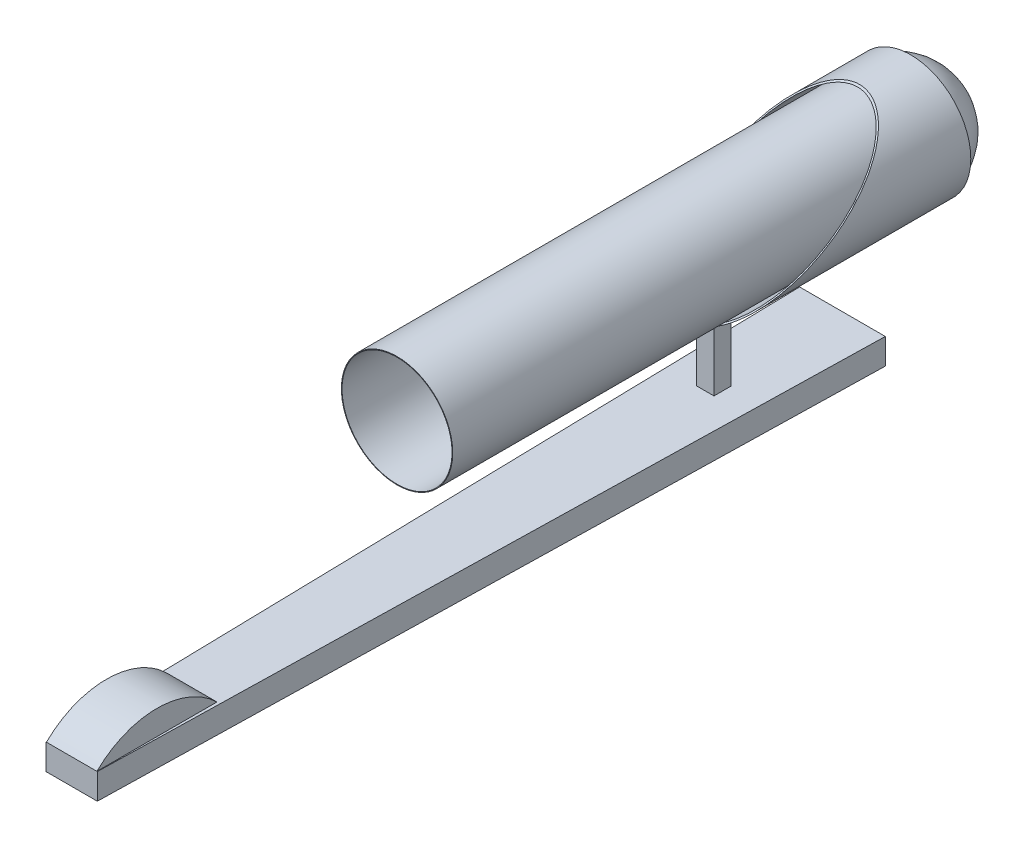
ISO-10303-21;
HEADER;
FILE_DESCRIPTION(('STEP AP214'),'2;1');
FILE_NAME('part.step','',(''),(''),'','','');
FILE_SCHEMA(('AUTOMOTIVE_DESIGN { 1 0 10303 214 1 1 1 1 }'));
ENDSEC;
DATA;
#1=APPLICATION_CONTEXT('core data for automotive mechanical design processes');
#2=APPLICATION_PROTOCOL_DEFINITION('international standard','automotive_design',2000,#1);
#3=PRODUCT_CONTEXT('',#1,'mechanical');
#4=PRODUCT('Part','Part','',(#3));
#5=PRODUCT_RELATED_PRODUCT_CATEGORY('part','',(#4));
#6=PRODUCT_DEFINITION_FORMATION('','',#4);
#7=PRODUCT_DEFINITION_CONTEXT('part definition',#1,'design');
#8=PRODUCT_DEFINITION('design','',#6,#7);
#9=PRODUCT_DEFINITION_SHAPE('','',#8);
#10=(LENGTH_UNIT() NAMED_UNIT(*) SI_UNIT(.MILLI.,.METRE.));
#11=(NAMED_UNIT(*) PLANE_ANGLE_UNIT() SI_UNIT($,.RADIAN.));
#12=(NAMED_UNIT(*) SI_UNIT($,.STERADIAN.) SOLID_ANGLE_UNIT());
#13=UNCERTAINTY_MEASURE_WITH_UNIT(LENGTH_MEASURE(1.E-05),#10,'distance_accuracy_value','');
#14=(GEOMETRIC_REPRESENTATION_CONTEXT(3) GLOBAL_UNCERTAINTY_ASSIGNED_CONTEXT((#13)) GLOBAL_UNIT_ASSIGNED_CONTEXT((#10,
#11,#12)) REPRESENTATION_CONTEXT('',''));
#15=CARTESIAN_POINT('',(0.,0.,0.));
#16=DIRECTION('',(0.,0.,1.));
#17=DIRECTION('',(1.,0.,0.));
#18=AXIS2_PLACEMENT_3D('',#15,#16,#17);
#19=CARTESIAN_POINT('',(0.,-7.493,0.));
#20=DIRECTION('',(0.,-1.,0.));
#21=DIRECTION('',(0.,0.,-1.));
#22=AXIS2_PLACEMENT_3D('',#19,#20,#21);
#23=PLANE('',#22);
#24=DIRECTION('',(-1.,0.,0.));
#25=VECTOR('',#24,1.);
#26=CARTESIAN_POINT('',(0.508,-7.493,-17.99844));
#27=LINE('',#26,#25);
#28=CARTESIAN_POINT('',(0.508,-7.493,-17.99844));
#29=VERTEX_POINT('',#28);
#30=CARTESIAN_POINT('',(-0.508,-7.493,-17.99844));
#31=VERTEX_POINT('',#30);
#32=EDGE_CURVE('E51',#29,#31,#27,.T.);
#33=ORIENTED_EDGE('',*,*,#32,.T.);
#34=DIRECTION('',(0.,0.,-1.));
#35=VECTOR('',#34,1.);
#36=CARTESIAN_POINT('',(-0.508,-7.493,-17.99844));
#37=LINE('',#36,#35);
#38=CARTESIAN_POINT('',(-0.508,-7.493,-18.9992));
#39=VERTEX_POINT('',#38);
#40=EDGE_CURVE('E190',#31,#39,#37,.T.);
#41=ORIENTED_EDGE('',*,*,#40,.T.);
#42=DIRECTION('',(-1.,0.,0.));
#43=VECTOR('',#42,1.);
#44=CARTESIAN_POINT('',(0.508,-7.493,-18.9992));
#45=LINE('',#44,#43);
#46=CARTESIAN_POINT('',(0.508,-7.493,-18.9992));
#47=VERTEX_POINT('',#46);
#48=EDGE_CURVE('E196',#47,#39,#45,.T.);
#49=ORIENTED_EDGE('',*,*,#48,.F.);
#50=DIRECTION('',(0.,0.,-1.));
#51=VECTOR('',#50,1.);
#52=CARTESIAN_POINT('',(0.508,-7.493,-17.99844));
#53=LINE('',#52,#51);
#54=EDGE_CURVE('E180',#29,#47,#53,.T.);
#55=ORIENTED_EDGE('',*,*,#54,.F.);
#56=EDGE_LOOP('',(#33,#41,#49,#55));
#57=FACE_BOUND('',#56,.T.);
#58=DIRECTION('',(0.,0.,-1.));
#59=VECTOR('',#58,1.);
#60=CARTESIAN_POINT('',(1.4732,-7.493,18.9992));
#61=LINE('',#60,#59);
#62=CARTESIAN_POINT('',(1.4732,-7.493,18.9992));
#63=VERTEX_POINT('',#62);
#64=CARTESIAN_POINT('',(1.4732,-7.493,11.9888));
#65=VERTEX_POINT('',#64);
#66=EDGE_CURVE('E131',#63,#65,#61,.T.);
#67=ORIENTED_EDGE('',*,*,#66,.F.);
#68=DIRECTION('',(1.,0.,0.));
#69=VECTOR('',#68,1.);
#70=CARTESIAN_POINT('',(1.4986,-7.493,18.9992));
#71=LINE('',#70,#69);
#72=CARTESIAN_POINT('',(1.4986,-7.493,18.9992));
#73=VERTEX_POINT('',#72);
#74=EDGE_CURVE('E119',#63,#73,#71,.T.);
#75=ORIENTED_EDGE('',*,*,#74,.T.);
#76=DIRECTION('',(0.0222856602321828,0.,-0.999751643833615));
#77=VECTOR('',#76,1.);
#78=CARTESIAN_POINT('',(2.5019,-7.493,-26.0096));
#79=LINE('',#78,#77);
#80=CARTESIAN_POINT('',(2.5019,-7.493,-26.0096));
#81=VERTEX_POINT('',#80);
#82=EDGE_CURVE('E163',#73,#81,#79,.T.);
#83=ORIENTED_EDGE('',*,*,#82,.T.);
#84=DIRECTION('',(-1.,0.,0.));
#85=VECTOR('',#84,1.);
#86=CARTESIAN_POINT('',(-2.5019,-7.493,-26.0096));
#87=LINE('',#86,#85);
#88=CARTESIAN_POINT('',(-2.5019,-7.493,-26.0096));
#89=VERTEX_POINT('',#88);
#90=EDGE_CURVE('E154',#81,#89,#87,.T.);
#91=ORIENTED_EDGE('',*,*,#90,.T.);
#92=DIRECTION('',(0.0222856602321827,0.,0.999751643833615));
#93=VECTOR('',#92,1.);
#94=CARTESIAN_POINT('',(-1.4986,-7.493,18.9992));
#95=LINE('',#94,#93);
#96=CARTESIAN_POINT('',(-1.4986,-7.493,18.9992));
#97=VERTEX_POINT('',#96);
#98=EDGE_CURVE('E129',#89,#97,#95,.T.);
#99=ORIENTED_EDGE('',*,*,#98,.T.);
#100=CARTESIAN_POINT('',(-1.4732,-7.493,18.9992));
#101=VERTEX_POINT('',#100);
#102=EDGE_CURVE('E128',#97,#101,#71,.T.);
#103=ORIENTED_EDGE('',*,*,#102,.T.);
#104=DIRECTION('',(0.,0.,-1.));
#105=VECTOR('',#104,1.);
#106=CARTESIAN_POINT('',(-1.4732,-7.493,18.9992));
#107=LINE('',#106,#105);
#108=CARTESIAN_POINT('',(-1.4732,-7.493,11.9888));
#109=VERTEX_POINT('',#108);
#110=EDGE_CURVE('E63',#101,#109,#107,.T.);
#111=ORIENTED_EDGE('',*,*,#110,.T.);
#112=DIRECTION('',(-1.,0.,0.));
#113=VECTOR('',#112,1.);
#114=CARTESIAN_POINT('',(1.4732,-7.493,11.9888));
#115=LINE('',#114,#113);
#116=EDGE_CURVE('E58',#65,#109,#115,.T.);
#117=ORIENTED_EDGE('',*,*,#116,.F.);
#118=EDGE_LOOP('',(#67,#75,#83,#91,#99,#103,#111,#117));
#119=FACE_BOUND('',#118,.T.);
#120=ADVANCED_FACE('F43',(#57,#119),#23,.F.);
#121=CARTESIAN_POINT('',(0.508,-3.5052,-17.99844));
#122=DIRECTION('',(0.,-1.,0.));
#123=DIRECTION('',(0.,0.,-1.));
#124=AXIS2_PLACEMENT_3D('',#121,#122,#123);
#125=PLANE('',#124);
#126=DIRECTION('',(0.,0.,1.));
#127=VECTOR('',#126,1.);
#128=CARTESIAN_POINT('',(-0.508,-3.5052,-17.99844));
#129=LINE('',#128,#127);
#130=CARTESIAN_POINT('',(-0.508,-3.5052,-18.9992));
#131=VERTEX_POINT('',#130);
#132=CARTESIAN_POINT('',(-0.508,-3.5052,-17.99844));
#133=VERTEX_POINT('',#132);
#134=EDGE_CURVE('E169',#131,#133,#129,.T.);
#135=ORIENTED_EDGE('',*,*,#134,.T.);
#136=DIRECTION('',(-1.,0.,0.));
#137=VECTOR('',#136,1.);
#138=CARTESIAN_POINT('',(0.508,-3.5052,-17.99844));
#139=LINE('',#138,#137);
#140=CARTESIAN_POINT('',(0.508,-3.5052,-17.99844));
#141=VERTEX_POINT('',#140);
#142=EDGE_CURVE('E12',#141,#133,#139,.T.);
#143=ORIENTED_EDGE('',*,*,#142,.F.);
#144=DIRECTION('',(0.,0.,1.));
#145=VECTOR('',#144,1.);
#146=CARTESIAN_POINT('',(0.508,-3.5052,-17.99844));
#147=LINE('',#146,#145);
#148=CARTESIAN_POINT('',(0.508,-3.5052,-18.9992));
#149=VERTEX_POINT('',#148);
#150=EDGE_CURVE('E174',#149,#141,#147,.T.);
#151=ORIENTED_EDGE('',*,*,#150,.F.);
#152=DIRECTION('',(-1.,0.,0.));
#153=VECTOR('',#152,1.);
#154=CARTESIAN_POINT('',(0.508,-3.5052,-18.9992));
#155=LINE('',#154,#153);
#156=EDGE_CURVE('E184',#149,#131,#155,.T.);
#157=ORIENTED_EDGE('',*,*,#156,.T.);
#158=EDGE_LOOP('',(#135,#143,#151,#157));
#159=FACE_BOUND('',#158,.T.);
#160=ADVANCED_FACE('F45',(#159),#125,.F.);
#161=CARTESIAN_POINT('',(0.508,-3.5052,-17.99844));
#162=DIRECTION('',(0.,0.,-1.));
#163=DIRECTION('',(-1.,0.,0.));
#164=AXIS2_PLACEMENT_3D('',#161,#162,#163);
#165=PLANE('',#164);
#166=DIRECTION('',(0.,-1.,0.));
#167=VECTOR('',#166,1.);
#168=CARTESIAN_POINT('',(-0.508,-3.5052,-17.99844));
#169=LINE('',#168,#167);
#170=EDGE_CURVE('E187',#133,#31,#169,.T.);
#171=ORIENTED_EDGE('',*,*,#170,.T.);
#172=ORIENTED_EDGE('',*,*,#32,.F.);
#173=DIRECTION('',(0.,-1.,0.));
#174=VECTOR('',#173,1.);
#175=CARTESIAN_POINT('',(0.508,-3.5052,-17.99844));
#176=LINE('',#175,#174);
#177=EDGE_CURVE('E177',#141,#29,#176,.T.);
#178=ORIENTED_EDGE('',*,*,#177,.F.);
#179=ORIENTED_EDGE('',*,*,#142,.T.);
#180=EDGE_LOOP('',(#171,#172,#178,#179));
#181=FACE_BOUND('',#180,.T.);
#182=ADVANCED_FACE('F203',(#181),#165,.F.);
#183=CARTESIAN_POINT('',(0.508,-7.493,-18.9992));
#184=DIRECTION('',(0.,0.,1.));
#185=DIRECTION('',(1.,0.,0.));
#186=AXIS2_PLACEMENT_3D('',#183,#184,#185);
#187=PLANE('',#186);
#188=DIRECTION('',(0.,1.,0.));
#189=VECTOR('',#188,1.);
#190=CARTESIAN_POINT('',(-0.508,-7.493,-18.9992));
#191=LINE('',#190,#189);
#192=EDGE_CURVE('E178',#39,#131,#191,.T.);
#193=ORIENTED_EDGE('',*,*,#192,.T.);
#194=ORIENTED_EDGE('',*,*,#156,.F.);
#195=DIRECTION('',(0.,1.,0.));
#196=VECTOR('',#195,1.);
#197=CARTESIAN_POINT('',(0.508,-7.493,-18.9992));
#198=LINE('',#197,#196);
#199=EDGE_CURVE('E182',#47,#149,#198,.T.);
#200=ORIENTED_EDGE('',*,*,#199,.F.);
#201=ORIENTED_EDGE('',*,*,#48,.T.);
#202=EDGE_LOOP('',(#193,#194,#200,#201));
#203=FACE_BOUND('',#202,.T.);
#204=ADVANCED_FACE('F211',(#203),#187,.F.);
#205=CARTESIAN_POINT('',(0.508,0.,0.));
#206=DIRECTION('',(1.,0.,0.));
#207=DIRECTION('',(0.,0.,-1.));
#208=AXIS2_PLACEMENT_3D('',#205,#206,#207);
#209=PLANE('',#208);
#210=ORIENTED_EDGE('',*,*,#150,.T.);
#211=ORIENTED_EDGE('',*,*,#177,.T.);
#212=ORIENTED_EDGE('',*,*,#54,.T.);
#213=ORIENTED_EDGE('',*,*,#199,.T.);
#214=EDGE_LOOP('',(#210,#211,#212,#213));
#215=FACE_BOUND('',#214,.T.);
#216=ADVANCED_FACE('F216',(#215),#209,.T.);
#217=CARTESIAN_POINT('',(-0.508,0.,0.));
#218=DIRECTION('',(1.,0.,0.));
#219=DIRECTION('',(0.,0.,-1.));
#220=AXIS2_PLACEMENT_3D('',#217,#218,#219);
#221=PLANE('',#220);
#222=ORIENTED_EDGE('',*,*,#134,.F.);
#223=ORIENTED_EDGE('',*,*,#192,.F.);
#224=ORIENTED_EDGE('',*,*,#40,.F.);
#225=ORIENTED_EDGE('',*,*,#170,.F.);
#226=EDGE_LOOP('',(#222,#223,#224,#225));
#227=FACE_BOUND('',#226,.T.);
#228=ADVANCED_FACE('F207',(#227),#221,.F.);
#229=CARTESIAN_POINT('',(-1.4986,-8.99414,18.9992));
#230=DIRECTION('',(-0.999751643833615,0.,0.0222856602321827));
#231=DIRECTION('',(0.0222856602321827,0.,0.999751643833615));
#232=AXIS2_PLACEMENT_3D('',#229,#230,#231);
#233=PLANE('',#232);
#234=ORIENTED_EDGE('',*,*,#98,.F.);
#235=DIRECTION('',(0.,1.,0.));
#236=VECTOR('',#235,1.);
#237=CARTESIAN_POINT('',(-2.5019,-8.99414,-26.0096));
#238=LINE('',#237,#236);
#239=CARTESIAN_POINT('',(-2.5019,-8.99414,-26.0096));
#240=VERTEX_POINT('',#239);
#241=EDGE_CURVE('E167',#240,#89,#238,.T.);
#242=ORIENTED_EDGE('',*,*,#241,.F.);
#243=DIRECTION('',(0.0222856602321827,0.,0.999751643833615));
#244=VECTOR('',#243,1.);
#245=CARTESIAN_POINT('',(-1.4986,-8.99414,18.9992));
#246=LINE('',#245,#244);
#247=CARTESIAN_POINT('',(-1.4986,-8.99414,18.9992));
#248=VERTEX_POINT('',#247);
#249=EDGE_CURVE('E150',#240,#248,#246,.T.);
#250=ORIENTED_EDGE('',*,*,#249,.T.);
#251=DIRECTION('',(0.,1.,0.));
#252=VECTOR('',#251,1.);
#253=CARTESIAN_POINT('',(-1.4986,-8.99414,18.9992));
#254=LINE('',#253,#252);
#255=EDGE_CURVE('E161',#248,#97,#254,.T.);
#256=ORIENTED_EDGE('',*,*,#255,.T.);
#257=EDGE_LOOP('',(#234,#242,#250,#256));
#258=FACE_BOUND('',#257,.T.);
#259=ADVANCED_FACE('F223',(#258),#233,.T.);
#260=CARTESIAN_POINT('',(-2.5019,-8.99414,-26.0096));
#261=DIRECTION('',(0.,0.,-1.));
#262=DIRECTION('',(-1.,0.,0.));
#263=AXIS2_PLACEMENT_3D('',#260,#261,#262);
#264=PLANE('',#263);
#265=ORIENTED_EDGE('',*,*,#90,.F.);
#266=DIRECTION('',(0.,1.,0.));
#267=VECTOR('',#266,1.);
#268=CARTESIAN_POINT('',(2.5019,-8.99414,-26.0096));
#269=LINE('',#268,#267);
#270=CARTESIAN_POINT('',(2.5019,-8.99414,-26.0096));
#271=VERTEX_POINT('',#270);
#272=EDGE_CURVE('E170',#271,#81,#269,.T.);
#273=ORIENTED_EDGE('',*,*,#272,.F.);
#274=DIRECTION('',(-1.,0.,0.));
#275=VECTOR('',#274,1.);
#276=CARTESIAN_POINT('',(-2.5019,-8.99414,-26.0096));
#277=LINE('',#276,#275);
#278=EDGE_CURVE('E159',#271,#240,#277,.T.);
#279=ORIENTED_EDGE('',*,*,#278,.T.);
#280=ORIENTED_EDGE('',*,*,#241,.T.);
#281=EDGE_LOOP('',(#265,#273,#279,#280));
#282=FACE_BOUND('',#281,.T.);
#283=ADVANCED_FACE('F236',(#282),#264,.T.);
#284=CARTESIAN_POINT('',(2.5019,-8.99414,-26.0096));
#285=DIRECTION('',(0.999751643833615,0.,0.0222856602321828));
#286=DIRECTION('',(0.0222856602321828,0.,-0.999751643833615));
#287=AXIS2_PLACEMENT_3D('',#284,#285,#286);
#288=PLANE('',#287);
#289=ORIENTED_EDGE('',*,*,#82,.F.);
#290=DIRECTION('',(0.,1.,0.));
#291=VECTOR('',#290,1.);
#292=CARTESIAN_POINT('',(1.4986,-8.99414,18.9992));
#293=LINE('',#292,#291);
#294=CARTESIAN_POINT('',(1.4986,-8.99414,18.9992));
#295=VERTEX_POINT('',#294);
#296=EDGE_CURVE('E125',#295,#73,#293,.T.);
#297=ORIENTED_EDGE('',*,*,#296,.F.);
#298=DIRECTION('',(0.0222856602321828,0.,-0.999751643833615));
#299=VECTOR('',#298,1.);
#300=CARTESIAN_POINT('',(2.5019,-8.99414,-26.0096));
#301=LINE('',#300,#299);
#302=EDGE_CURVE('E156',#295,#271,#301,.T.);
#303=ORIENTED_EDGE('',*,*,#302,.T.);
#304=ORIENTED_EDGE('',*,*,#272,.T.);
#305=EDGE_LOOP('',(#289,#297,#303,#304));
#306=FACE_BOUND('',#305,.T.);
#307=ADVANCED_FACE('F239',(#306),#288,.T.);
#308=CARTESIAN_POINT('',(1.4986,-8.99414,18.9992));
#309=DIRECTION('',(0.,0.,1.));
#310=DIRECTION('',(1.,0.,0.));
#311=AXIS2_PLACEMENT_3D('',#308,#309,#310);
#312=PLANE('',#311);
#313=ORIENTED_EDGE('',*,*,#102,.F.);
#314=ORIENTED_EDGE('',*,*,#255,.F.);
#315=DIRECTION('',(1.,0.,0.));
#316=VECTOR('',#315,1.);
#317=CARTESIAN_POINT('',(1.4986,-8.99414,18.9992));
#318=LINE('',#317,#316);
#319=EDGE_CURVE('E153',#248,#295,#318,.T.);
#320=ORIENTED_EDGE('',*,*,#319,.T.);
#321=ORIENTED_EDGE('',*,*,#296,.T.);
#322=ORIENTED_EDGE('',*,*,#74,.F.);
#323=DIRECTION('',(-1.,0.,0.));
#324=VECTOR('',#323,1.);
#325=CARTESIAN_POINT('',(1.4732,-7.493,18.9992));
#326=LINE('',#325,#324);
#327=EDGE_CURVE('E123',#63,#101,#326,.T.);
#328=ORIENTED_EDGE('',*,*,#327,.T.);
#329=EDGE_LOOP('',(#313,#314,#320,#321,#322,#328));
#330=FACE_BOUND('',#329,.T.);
#331=ADVANCED_FACE('F121',(#330),#312,.T.);
#332=CARTESIAN_POINT('',(0.,-8.99414,0.));
#333=DIRECTION('',(0.,-1.,0.));
#334=DIRECTION('',(0.,0.,-1.));
#335=AXIS2_PLACEMENT_3D('',#332,#333,#334);
#336=PLANE('',#335);
#337=ORIENTED_EDGE('',*,*,#249,.F.);
#338=ORIENTED_EDGE('',*,*,#278,.F.);
#339=ORIENTED_EDGE('',*,*,#302,.F.);
#340=ORIENTED_EDGE('',*,*,#319,.F.);
#341=EDGE_LOOP('',(#337,#338,#339,#340));
#342=FACE_BOUND('',#341,.T.);
#343=ADVANCED_FACE('F234',(#342),#336,.T.);
#344=CARTESIAN_POINT('',(1.4732,-11.0639364878138,15.494));
#345=DIRECTION('',(-1.,0.,0.));
#346=DIRECTION('',(0.,0.,1.));
#347=AXIS2_PLACEMENT_3D('',#344,#345,#346);
#348=CYLINDRICAL_SURFACE('',#347,5.0038);
#349=CARTESIAN_POINT('',(-1.4732,-11.0639364878138,15.494));
#350=DIRECTION('',(1.,0.,0.));
#351=DIRECTION('',(0.,0.,1.));
#352=AXIS2_PLACEMENT_3D('',#349,#350,#351);
#353=CIRCLE('',#352,5.0038);
#354=EDGE_CURVE('E143',#109,#101,#353,.T.);
#355=ORIENTED_EDGE('',*,*,#354,.T.);
#356=ORIENTED_EDGE('',*,*,#327,.F.);
#357=CARTESIAN_POINT('',(1.4732,-11.0639364878138,15.494));
#358=DIRECTION('',(1.,0.,0.));
#359=DIRECTION('',(0.,0.,1.));
#360=AXIS2_PLACEMENT_3D('',#357,#358,#359);
#361=CIRCLE('',#360,5.0038);
#362=EDGE_CURVE('E135',#65,#63,#361,.T.);
#363=ORIENTED_EDGE('',*,*,#362,.F.);
#364=ORIENTED_EDGE('',*,*,#116,.T.);
#365=EDGE_LOOP('',(#355,#356,#363,#364));
#366=FACE_BOUND('',#365,.T.);
#367=ADVANCED_FACE('F141',(#366),#348,.T.);
#368=CARTESIAN_POINT('',(1.4732,-11.0639364878138,15.494));
#369=DIRECTION('',(-1.,0.,0.));
#370=DIRECTION('',(0.,0.,1.));
#371=AXIS2_PLACEMENT_3D('',#368,#369,#370);
#372=PLANE('',#371);
#373=ORIENTED_EDGE('',*,*,#362,.T.);
#374=ORIENTED_EDGE('',*,*,#66,.T.);
#375=EDGE_LOOP('',(#373,#374));
#376=FACE_BOUND('',#375,.T.);
#377=ADVANCED_FACE('F137',(#376),#372,.F.);
#378=CARTESIAN_POINT('',(-1.4732,-11.0639364878138,15.494));
#379=DIRECTION('',(-1.,0.,0.));
#380=DIRECTION('',(0.,0.,1.));
#381=AXIS2_PLACEMENT_3D('',#378,#379,#380);
#382=PLANE('',#381);
#383=ORIENTED_EDGE('',*,*,#354,.F.);
#384=ORIENTED_EDGE('',*,*,#110,.F.);
#385=EDGE_LOOP('',(#383,#384));
#386=FACE_BOUND('',#385,.T.);
#387=ADVANCED_FACE('F257',(#386),#382,.T.);
#388=CLOSED_SHELL('',(#120,#160,#182,#204,#216,#228,#259,#283,#307,#331,#343,#367,#377,#387));
#389=MANIFOLD_SOLID_BREP('B2',#388);
#390=CARTESIAN_POINT('',(0.,0.,-29.9974));
#391=DIRECTION('',(0.,0.,1.));
#392=DIRECTION('',(1.,0.,0.));
#393=AXIS2_PLACEMENT_3D('',#390,#391,#392);
#394=CYLINDRICAL_SURFACE('',#393,3.2512);
#395=CARTESIAN_POINT('',(0.,0.,-29.9974));
#396=DIRECTION('',(0.,0.,1.));
#397=DIRECTION('',(1.,0.,0.));
#398=AXIS2_PLACEMENT_3D('',#395,#396,#397);
#399=CIRCLE('',#398,3.2512);
#400=CARTESIAN_POINT('',(3.2512,0.,-29.9974));
#401=VERTEX_POINT('',#400);
#402=EDGE_CURVE('E42',#401,#401,#399,.T.);
#403=ORIENTED_EDGE('',*,*,#402,.T.);
#404=EDGE_LOOP('',(#403));
#405=FACE_BOUND('',#404,.T.);
#406=CARTESIAN_POINT('',(0.,0.,0.));
#407=DIRECTION('',(0.,0.,1.));
#408=DIRECTION('',(1.,0.,0.));
#409=AXIS2_PLACEMENT_3D('',#406,#407,#408);
#410=CIRCLE('',#409,3.2512);
#411=CARTESIAN_POINT('',(3.2512,0.,0.));
#412=VERTEX_POINT('',#411);
#413=EDGE_CURVE('E360',#412,#412,#410,.T.);
#414=ORIENTED_EDGE('',*,*,#413,.F.);
#415=EDGE_LOOP('',(#414));
#416=FACE_BOUND('',#415,.T.);
#417=ADVANCED_FACE('F353',(#405,#416),#394,.T.);
#418=CARTESIAN_POINT('',(0.,0.,-29.186632));
#419=DIRECTION('',(0.,0.,1.));
#420=DIRECTION('',(1.,0.,0.));
#421=AXIS2_PLACEMENT_3D('',#418,#419,#420);
#422=SPHERICAL_SURFACE('',#421,3.350768);
#423=ORIENTED_EDGE('',*,*,#402,.F.);
#424=EDGE_LOOP('',(#423));
#425=FACE_BOUND('',#424,.T.);
#426=ADVANCED_FACE('F355',(#425),#422,.T.);
#427=CARTESIAN_POINT('',(0.,0.,0.));
#428=DIRECTION('',(0.,0.,1.));
#429=DIRECTION('',(1.,0.,0.));
#430=AXIS2_PLACEMENT_3D('',#427,#428,#429);
#431=PLANE('',#430);
#432=CARTESIAN_POINT('',(0.,0.,0.));
#433=DIRECTION('',(0.,0.,1.));
#434=DIRECTION('',(1.,0.,0.));
#435=AXIS2_PLACEMENT_3D('',#432,#433,#434);
#436=CIRCLE('',#435,3.2131);
#437=CARTESIAN_POINT('',(3.2131,0.,0.));
#438=VERTEX_POINT('',#437);
#439=EDGE_CURVE('E368',#438,#438,#436,.T.);
#440=ORIENTED_EDGE('',*,*,#439,.F.);
#441=EDGE_LOOP('',(#440));
#442=FACE_BOUND('',#441,.T.);
#443=ORIENTED_EDGE('',*,*,#413,.T.);
#444=EDGE_LOOP('',(#443));
#445=FACE_BOUND('',#444,.T.);
#446=ADVANCED_FACE('F376',(#442,#445),#431,.T.);
#447=CARTESIAN_POINT('',(0.,0.,-25.4));
#448=DIRECTION('',(0.,0.,1.));
#449=DIRECTION('',(1.,0.,0.));
#450=AXIS2_PLACEMENT_3D('',#447,#448,#449);
#451=CYLINDRICAL_SURFACE('',#450,3.2131);
#452=CARTESIAN_POINT('',(0.,0.,-25.4));
#453=DIRECTION('',(0.,0.,1.));
#454=DIRECTION('',(1.,0.,0.));
#455=AXIS2_PLACEMENT_3D('',#452,#453,#454);
#456=CIRCLE('',#455,3.2131);
#457=CARTESIAN_POINT('',(3.2131,0.,-25.4));
#458=VERTEX_POINT('',#457);
#459=EDGE_CURVE('E364',#458,#458,#456,.T.);
#460=ORIENTED_EDGE('',*,*,#459,.F.);
#461=EDGE_LOOP('',(#460));
#462=FACE_BOUND('',#461,.T.);
#463=ORIENTED_EDGE('',*,*,#439,.T.);
#464=EDGE_LOOP('',(#463));
#465=FACE_BOUND('',#464,.T.);
#466=ADVANCED_FACE('F374',(#462,#465),#451,.F.);
#467=CARTESIAN_POINT('',(0.,0.,-25.4));
#468=DIRECTION('',(0.,0.,1.));
#469=DIRECTION('',(1.,0.,0.));
#470=AXIS2_PLACEMENT_3D('',#467,#468,#469);
#471=PLANE('',#470);
#472=ORIENTED_EDGE('',*,*,#459,.T.);
#473=EDGE_LOOP('',(#472));
#474=FACE_BOUND('',#473,.T.);
#475=ADVANCED_FACE('F383',(#474),#471,.T.);
#476=CLOSED_SHELL('',(#417,#426,#446,#466,#475));
#477=MANIFOLD_SOLID_BREP('B6',#476);
#478=CARTESIAN_POINT('',(0.,0.,-29.9974));
#479=DIRECTION('',(0.,0.,1.));
#480=DIRECTION('',(1.,0.,0.));
#481=AXIS2_PLACEMENT_3D('',#478,#479,#480);
#482=PLANE('',#481);
#483=CARTESIAN_POINT('',(0.,0.,-29.9974));
#484=DIRECTION('',(0.,0.,-1.));
#485=DIRECTION('',(-1.,0.,0.));
#486=AXIS2_PLACEMENT_3D('',#483,#484,#485);
#487=CIRCLE('',#486,3.429);
#488=CARTESIAN_POINT('',(-3.429,0.,-29.9974));
#489=VERTEX_POINT('',#488);
#490=EDGE_CURVE('E437',#489,#489,#487,.T.);
#491=ORIENTED_EDGE('',*,*,#490,.F.);
#492=EDGE_LOOP('',(#491));
#493=FACE_BOUND('',#492,.T.);
#494=CARTESIAN_POINT('',(0.,0.,-29.9974));
#495=DIRECTION('',(0.,0.,1.));
#496=DIRECTION('',(1.,0.,0.));
#497=AXIS2_PLACEMENT_3D('',#494,#495,#496);
#498=CIRCLE('',#497,3.5052);
#499=CARTESIAN_POINT('',(3.5052,0.,-29.9974));
#500=VERTEX_POINT('',#499);
#501=EDGE_CURVE('E431',#500,#500,#498,.T.);
#502=ORIENTED_EDGE('',*,*,#501,.F.);
#503=EDGE_LOOP('',(#502));
#504=FACE_BOUND('',#503,.T.);
#505=ADVANCED_FACE('F423',(#493,#504),#482,.F.);
#506=CARTESIAN_POINT('',(0.,0.,-29.9974));
#507=DIRECTION('',(0.,0.,1.));
#508=DIRECTION('',(1.,0.,0.));
#509=AXIS2_PLACEMENT_3D('',#506,#507,#508);
#510=CYLINDRICAL_SURFACE('',#509,3.5052);
#511=CARTESIAN_POINT('',(0.,0.,-21.9985443932324));
#512=DIRECTION('',(0.,-0.819152044288989,-0.57357643635105));
#513=DIRECTION('',(0.,-0.57357643635105,0.819152044288989));
#514=AXIS2_PLACEMENT_3D('',#511,#512,#513);
#515=ELLIPSE('',#514,6.11112970801103,3.5052);
#516=CARTESIAN_POINT('',(0.,-3.5052,-16.9926));
#517=VERTEX_POINT('',#516);
#518=EDGE_CURVE('E352',#517,#517,#515,.F.);
#519=ORIENTED_EDGE('',*,*,#518,.F.);
#520=EDGE_LOOP('',(#519));
#521=FACE_BOUND('',#520,.T.);
#522=ORIENTED_EDGE('',*,*,#501,.T.);
#523=EDGE_LOOP('',(#522));
#524=FACE_BOUND('',#523,.T.);
#525=ADVANCED_FACE('F425',(#521,#524),#510,.T.);
#526=CARTESIAN_POINT('',(-14.9987,-3.5052,-16.9926));
#527=DIRECTION('',(0.,-0.819152044288989,-0.57357643635105));
#528=DIRECTION('',(0.,0.57357643635105,-0.819152044288989));
#529=AXIS2_PLACEMENT_3D('',#526,#527,#528);
#530=PLANE('',#529);
#531=CARTESIAN_POINT('',(0.,0.,-21.9985443932324));
#532=DIRECTION('',(0.,-0.819152044288989,-0.57357643635105));
#533=DIRECTION('',(0.,0.57357643635105,-0.819152044288989));
#534=AXIS2_PLACEMENT_3D('',#531,#532,#533);
#535=ELLIPSE('',#534,5.9782790621847,3.429);
#536=CARTESIAN_POINT('',(0.,3.429,-26.8956639083511));
#537=VERTEX_POINT('',#536);
#538=EDGE_CURVE('E427',#537,#537,#535,.T.);
#539=ORIENTED_EDGE('',*,*,#538,.T.);
#540=EDGE_LOOP('',(#539));
#541=FACE_BOUND('',#540,.T.);
#542=ORIENTED_EDGE('',*,*,#518,.T.);
#543=EDGE_LOOP('',(#542));
#544=FACE_BOUND('',#543,.T.);
#545=ADVANCED_FACE('F444',(#541,#544),#530,.F.);
#546=CARTESIAN_POINT('',(0.,0.,0.));
#547=DIRECTION('',(0.,0.,-1.));
#548=DIRECTION('',(-1.,0.,0.));
#549=AXIS2_PLACEMENT_3D('',#546,#547,#548);
#550=CYLINDRICAL_SURFACE('',#549,3.429);
#551=ORIENTED_EDGE('',*,*,#490,.T.);
#552=EDGE_LOOP('',(#551));
#553=FACE_BOUND('',#552,.T.);
#554=ORIENTED_EDGE('',*,*,#538,.F.);
#555=EDGE_LOOP('',(#554));
#556=FACE_BOUND('',#555,.T.);
#557=ADVANCED_FACE('F446',(#553,#556),#550,.F.);
#558=CLOSED_SHELL('',(#505,#525,#545,#557));
#559=MANIFOLD_SOLID_BREP('B37',#558);
#560=ADVANCED_BREP_SHAPE_REPRESENTATION('',(#18,#389,#477,#559),#14);
#561=SHAPE_DEFINITION_REPRESENTATION(#9,#560);
ENDSEC;
END-ISO-10303-21;
